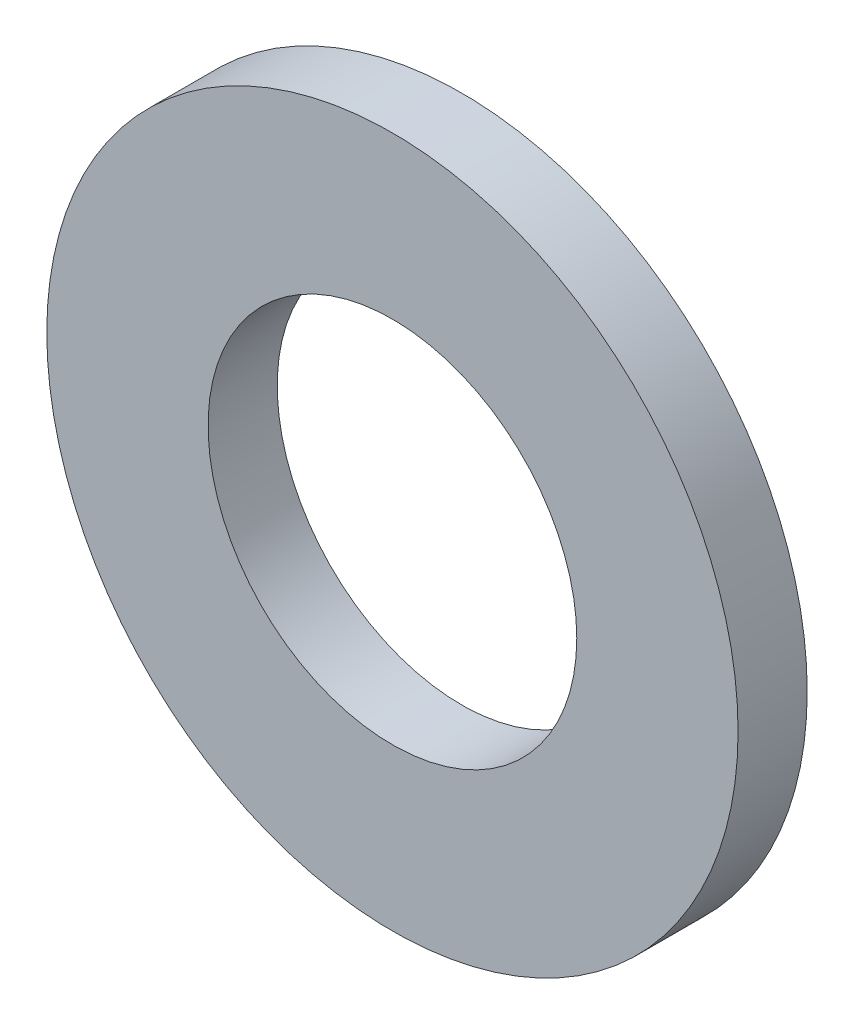
ISO-10303-21;
HEADER;
FILE_DESCRIPTION(('STEP AP214'),'2;1');
FILE_NAME('part.step','',(''),(''),'','','');
FILE_SCHEMA(('AUTOMOTIVE_DESIGN { 1 0 10303 214 1 1 1 1 }'));
ENDSEC;
DATA;
#1=APPLICATION_CONTEXT('core data for automotive mechanical design processes');
#2=APPLICATION_PROTOCOL_DEFINITION('international standard','automotive_design',2000,#1);
#3=PRODUCT_CONTEXT('',#1,'mechanical');
#4=PRODUCT('Part','Part','',(#3));
#5=PRODUCT_RELATED_PRODUCT_CATEGORY('part','',(#4));
#6=PRODUCT_DEFINITION_FORMATION('','',#4);
#7=PRODUCT_DEFINITION_CONTEXT('part definition',#1,'design');
#8=PRODUCT_DEFINITION('design','',#6,#7);
#9=PRODUCT_DEFINITION_SHAPE('','',#8);
#10=(LENGTH_UNIT() NAMED_UNIT(*) SI_UNIT(.MILLI.,.METRE.));
#11=(NAMED_UNIT(*) PLANE_ANGLE_UNIT() SI_UNIT($,.RADIAN.));
#12=(NAMED_UNIT(*) SI_UNIT($,.STERADIAN.) SOLID_ANGLE_UNIT());
#13=UNCERTAINTY_MEASURE_WITH_UNIT(LENGTH_MEASURE(1.E-05),#10,'distance_accuracy_value','');
#14=(GEOMETRIC_REPRESENTATION_CONTEXT(3) GLOBAL_UNCERTAINTY_ASSIGNED_CONTEXT((#13)) GLOBAL_UNIT_ASSIGNED_CONTEXT((#10,
#11,#12)) REPRESENTATION_CONTEXT('',''));
#15=CARTESIAN_POINT('',(0.,0.,0.));
#16=DIRECTION('',(0.,0.,1.));
#17=DIRECTION('',(1.,0.,0.));
#18=AXIS2_PLACEMENT_3D('',#15,#16,#17);
#19=CARTESIAN_POINT('',(0.,0.,0.6));
#20=DIRECTION('',(0.,0.,1.));
#21=DIRECTION('',(1.,0.,0.));
#22=AXIS2_PLACEMENT_3D('',#19,#20,#21);
#23=PLANE('',#22);
#24=CARTESIAN_POINT('',(0.,0.,0.6));
#25=DIRECTION('',(0.,0.,1.));
#26=DIRECTION('',(1.,0.,0.));
#27=AXIS2_PLACEMENT_3D('',#24,#25,#26);
#28=CIRCLE('',#27,3.);
#29=CARTESIAN_POINT('',(3.,0.,0.6));
#30=VERTEX_POINT('',#29);
#31=EDGE_CURVE('E10',#30,#30,#28,.T.);
#32=ORIENTED_EDGE('',*,*,#31,.T.);
#33=EDGE_LOOP('',(#32));
#34=FACE_BOUND('',#33,.T.);
#35=CARTESIAN_POINT('',(0.,0.,0.6));
#36=DIRECTION('',(0.,0.,1.));
#37=DIRECTION('',(1.,0.,0.));
#38=AXIS2_PLACEMENT_3D('',#35,#36,#37);
#39=CIRCLE('',#38,1.6);
#40=CARTESIAN_POINT('',(1.6,0.,0.6));
#41=VERTEX_POINT('',#40);
#42=EDGE_CURVE('E50',#41,#41,#39,.T.);
#43=ORIENTED_EDGE('',*,*,#42,.F.);
#44=EDGE_LOOP('',(#43));
#45=FACE_BOUND('',#44,.T.);
#46=ADVANCED_FACE('F36',(#34,#45),#23,.T.);
#47=CARTESIAN_POINT('',(0.,0.,0.));
#48=DIRECTION('',(0.,0.,1.));
#49=DIRECTION('',(1.,0.,0.));
#50=AXIS2_PLACEMENT_3D('',#47,#48,#49);
#51=PLANE('',#50);
#52=CARTESIAN_POINT('',(0.,0.,0.));
#53=DIRECTION('',(0.,0.,1.));
#54=DIRECTION('',(1.,0.,0.));
#55=AXIS2_PLACEMENT_3D('',#52,#53,#54);
#56=CIRCLE('',#55,3.);
#57=CARTESIAN_POINT('',(3.,0.,0.));
#58=VERTEX_POINT('',#57);
#59=EDGE_CURVE('E40',#58,#58,#56,.T.);
#60=ORIENTED_EDGE('',*,*,#59,.F.);
#61=EDGE_LOOP('',(#60));
#62=FACE_BOUND('',#61,.T.);
#63=CARTESIAN_POINT('',(0.,0.,0.));
#64=DIRECTION('',(0.,0.,1.));
#65=DIRECTION('',(1.,0.,0.));
#66=AXIS2_PLACEMENT_3D('',#63,#64,#65);
#67=CIRCLE('',#66,1.6);
#68=CARTESIAN_POINT('',(1.6,0.,0.));
#69=VERTEX_POINT('',#68);
#70=EDGE_CURVE('E52',#69,#69,#67,.T.);
#71=ORIENTED_EDGE('',*,*,#70,.T.);
#72=EDGE_LOOP('',(#71));
#73=FACE_BOUND('',#72,.T.);
#74=ADVANCED_FACE('F63',(#62,#73),#51,.F.);
#75=CARTESIAN_POINT('',(0.,0.,0.6));
#76=DIRECTION('',(0.,0.,-1.));
#77=DIRECTION('',(-1.,0.,0.));
#78=AXIS2_PLACEMENT_3D('',#75,#76,#77);
#79=CYLINDRICAL_SURFACE('',#78,3.);
#80=ORIENTED_EDGE('',*,*,#31,.F.);
#81=EDGE_LOOP('',(#80));
#82=FACE_BOUND('',#81,.T.);
#83=ORIENTED_EDGE('',*,*,#59,.T.);
#84=EDGE_LOOP('',(#83));
#85=FACE_BOUND('',#84,.T.);
#86=ADVANCED_FACE('F38',(#82,#85),#79,.T.);
#87=CARTESIAN_POINT('',(0.,0.,0.6));
#88=DIRECTION('',(0.,0.,-1.));
#89=DIRECTION('',(-1.,0.,0.));
#90=AXIS2_PLACEMENT_3D('',#87,#88,#89);
#91=CYLINDRICAL_SURFACE('',#90,1.6);
#92=ORIENTED_EDGE('',*,*,#42,.T.);
#93=EDGE_LOOP('',(#92));
#94=FACE_BOUND('',#93,.T.);
#95=ORIENTED_EDGE('',*,*,#70,.F.);
#96=EDGE_LOOP('',(#95));
#97=FACE_BOUND('',#96,.T.);
#98=ADVANCED_FACE('F59',(#94,#97),#91,.F.);
#99=CLOSED_SHELL('',(#46,#74,#86,#98));
#100=MANIFOLD_SOLID_BREP('B2',#99);
#101=ADVANCED_BREP_SHAPE_REPRESENTATION('',(#18,#100),#14);
#102=SHAPE_DEFINITION_REPRESENTATION(#9,#101);
ENDSEC;
END-ISO-10303-21;
